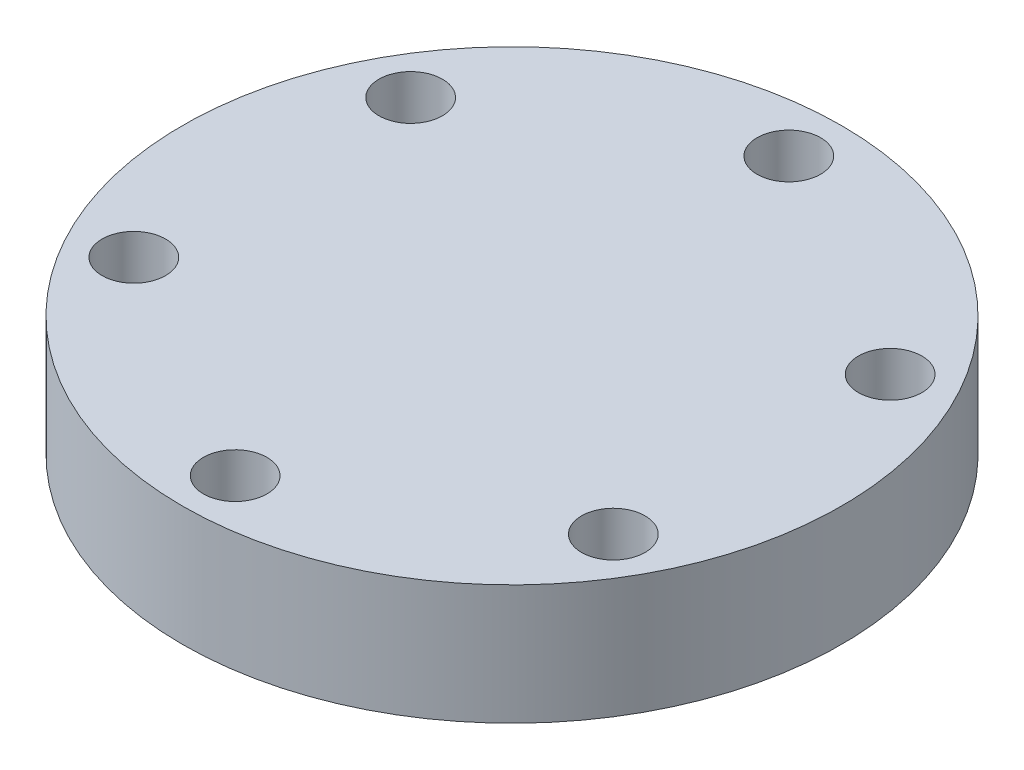
ISO-10303-21;
HEADER;
FILE_DESCRIPTION(('STEP AP214'),'2;1');
FILE_NAME('part.step','',(''),(''),'','','');
FILE_SCHEMA(('AUTOMOTIVE_DESIGN { 1 0 10303 214 1 1 1 1 }'));
ENDSEC;
DATA;
#1=APPLICATION_CONTEXT('core data for automotive mechanical design processes');
#2=APPLICATION_PROTOCOL_DEFINITION('international standard','automotive_design',2000,#1);
#3=PRODUCT_CONTEXT('',#1,'mechanical');
#4=PRODUCT('Part','Part','',(#3));
#5=PRODUCT_RELATED_PRODUCT_CATEGORY('part','',(#4));
#6=PRODUCT_DEFINITION_FORMATION('','',#4);
#7=PRODUCT_DEFINITION_CONTEXT('part definition',#1,'design');
#8=PRODUCT_DEFINITION('design','',#6,#7);
#9=PRODUCT_DEFINITION_SHAPE('','',#8);
#10=(LENGTH_UNIT() NAMED_UNIT(*) SI_UNIT(.MILLI.,.METRE.));
#11=(NAMED_UNIT(*) PLANE_ANGLE_UNIT() SI_UNIT($,.RADIAN.));
#12=(NAMED_UNIT(*) SI_UNIT($,.STERADIAN.) SOLID_ANGLE_UNIT());
#13=UNCERTAINTY_MEASURE_WITH_UNIT(LENGTH_MEASURE(1.E-05),#10,'distance_accuracy_value','');
#14=(GEOMETRIC_REPRESENTATION_CONTEXT(3) GLOBAL_UNCERTAINTY_ASSIGNED_CONTEXT((#13)) GLOBAL_UNIT_ASSIGNED_CONTEXT((#10,
#11,#12)) REPRESENTATION_CONTEXT('',''));
#15=CARTESIAN_POINT('',(0.,0.,0.));
#16=DIRECTION('',(0.,0.,1.));
#17=DIRECTION('',(1.,0.,0.));
#18=AXIS2_PLACEMENT_3D('',#15,#16,#17);
#19=CARTESIAN_POINT('',(0.,12.7,0.));
#20=DIRECTION('',(0.,1.,0.));
#21=DIRECTION('',(0.,0.,1.));
#22=AXIS2_PLACEMENT_3D('',#19,#20,#21);
#23=PLANE('',#22);
#24=CARTESIAN_POINT('',(25.4065872708242,12.7,14.6684999999998));
#25=DIRECTION('',(0.,1.,0.));
#26=DIRECTION('',(-0.866025403784443,0.,-0.499999999999992));
#27=AXIS2_PLACEMENT_3D('',#24,#25,#26);
#28=CIRCLE('',#27,3.3655);
#29=CARTESIAN_POINT('',(22.4919787743877,12.7,12.9857499999998));
#30=VERTEX_POINT('',#29);
#31=EDGE_CURVE('E62',#30,#30,#28,.T.);
#32=ORIENTED_EDGE('',*,*,#31,.F.);
#33=EDGE_LOOP('',(#32));
#34=FACE_BOUND('',#33,.T.);
#35=CARTESIAN_POINT('',(-25.406587270824,12.7,14.6685000000001));
#36=DIRECTION('',(0.,1.,0.));
#37=DIRECTION('',(0.866025403784436,0.,-0.500000000000004));
#38=AXIS2_PLACEMENT_3D('',#35,#36,#37);
#39=CIRCLE('',#38,3.3655);
#40=CARTESIAN_POINT('',(-22.4919787743875,12.7,12.9857500000001));
#41=VERTEX_POINT('',#40);
#42=EDGE_CURVE('E50',#41,#41,#39,.T.);
#43=ORIENTED_EDGE('',*,*,#42,.F.);
#44=EDGE_LOOP('',(#43));
#45=FACE_BOUND('',#44,.T.);
#46=CARTESIAN_POINT('',(0.,12.7,-29.337));
#47=DIRECTION('',(0.,1.,0.));
#48=DIRECTION('',(0.,0.,1.));
#49=AXIS2_PLACEMENT_3D('',#46,#47,#48);
#50=CIRCLE('',#49,3.3655);
#51=CARTESIAN_POINT('',(0.,12.7,-25.9715));
#52=VERTEX_POINT('',#51);
#53=EDGE_CURVE('E39',#52,#52,#50,.T.);
#54=ORIENTED_EDGE('',*,*,#53,.F.);
#55=EDGE_LOOP('',(#54));
#56=FACE_BOUND('',#55,.T.);
#57=CARTESIAN_POINT('',(0.,12.7,0.));
#58=DIRECTION('',(0.,1.,0.));
#59=DIRECTION('',(0.,0.,1.));
#60=AXIS2_PLACEMENT_3D('',#57,#58,#59);
#61=CIRCLE('',#60,34.925);
#62=CARTESIAN_POINT('',(0.,12.7,34.925));
#63=VERTEX_POINT('',#62);
#64=EDGE_CURVE('E10',#63,#63,#61,.T.);
#65=ORIENTED_EDGE('',*,*,#64,.T.);
#66=EDGE_LOOP('',(#65));
#67=FACE_BOUND('',#66,.T.);
#68=CARTESIAN_POINT('',(-25.4065872708241,12.7,-14.6684999999999));
#69=DIRECTION('',(0.,1.,0.));
#70=DIRECTION('',(0.86602540378444,0.,0.499999999999998));
#71=AXIS2_PLACEMENT_3D('',#68,#69,#70);
#72=CIRCLE('',#71,3.3655);
#73=CARTESIAN_POINT('',(-22.4919787743876,12.7,-12.9857499999999));
#74=VERTEX_POINT('',#73);
#75=EDGE_CURVE('E44',#74,#74,#72,.T.);
#76=ORIENTED_EDGE('',*,*,#75,.F.);
#77=EDGE_LOOP('',(#76));
#78=FACE_BOUND('',#77,.T.);
#79=CARTESIAN_POINT('',(2.04859176075282E-13,12.7,29.337));
#80=DIRECTION('',(0.,1.,0.));
#81=DIRECTION('',(0.,0.,-1.));
#82=AXIS2_PLACEMENT_3D('',#79,#80,#81);
#83=CIRCLE('',#82,3.3655);
#84=CARTESIAN_POINT('',(1.81358015183529E-13,12.7,25.9715));
#85=VERTEX_POINT('',#84);
#86=EDGE_CURVE('E56',#85,#85,#83,.T.);
#87=ORIENTED_EDGE('',*,*,#86,.F.);
#88=EDGE_LOOP('',(#87));
#89=FACE_BOUND('',#88,.T.);
#90=CARTESIAN_POINT('',(25.4065872708239,12.7,-14.6685000000003));
#91=DIRECTION('',(0.,1.,0.));
#92=DIRECTION('',(-0.866025403784433,0.,0.50000000000001));
#93=AXIS2_PLACEMENT_3D('',#90,#91,#92);
#94=CIRCLE('',#93,3.3655);
#95=CARTESIAN_POINT('',(22.4919787743874,12.7,-12.9857500000003));
#96=VERTEX_POINT('',#95);
#97=EDGE_CURVE('E68',#96,#96,#94,.T.);
#98=ORIENTED_EDGE('',*,*,#97,.F.);
#99=EDGE_LOOP('',(#98));
#100=FACE_BOUND('',#99,.T.);
#101=ADVANCED_FACE('F28',(#34,#45,#56,#67,#78,#89,#100),#23,.T.);
#102=CARTESIAN_POINT('',(0.,0.,0.));
#103=DIRECTION('',(0.,1.,0.));
#104=DIRECTION('',(0.,0.,1.));
#105=AXIS2_PLACEMENT_3D('',#102,#103,#104);
#106=PLANE('',#105);
#107=CARTESIAN_POINT('',(25.4065872708242,0.,14.6684999999998));
#108=DIRECTION('',(0.,1.,0.));
#109=DIRECTION('',(-0.866025403784443,0.,-0.499999999999992));
#110=AXIS2_PLACEMENT_3D('',#107,#108,#109);
#111=CIRCLE('',#110,3.3655);
#112=CARTESIAN_POINT('',(22.4919787743877,0.,12.9857499999998));
#113=VERTEX_POINT('',#112);
#114=EDGE_CURVE('E65',#113,#113,#111,.T.);
#115=ORIENTED_EDGE('',*,*,#114,.T.);
#116=EDGE_LOOP('',(#115));
#117=FACE_BOUND('',#116,.T.);
#118=CARTESIAN_POINT('',(-25.406587270824,0.,14.6685000000001));
#119=DIRECTION('',(0.,1.,0.));
#120=DIRECTION('',(0.866025403784436,0.,-0.500000000000004));
#121=AXIS2_PLACEMENT_3D('',#118,#119,#120);
#122=CIRCLE('',#121,3.3655);
#123=CARTESIAN_POINT('',(-22.4919787743875,0.,12.9857500000001));
#124=VERTEX_POINT('',#123);
#125=EDGE_CURVE('E53',#124,#124,#122,.T.);
#126=ORIENTED_EDGE('',*,*,#125,.T.);
#127=EDGE_LOOP('',(#126));
#128=FACE_BOUND('',#127,.T.);
#129=CARTESIAN_POINT('',(0.,0.,-29.337));
#130=DIRECTION('',(0.,1.,0.));
#131=DIRECTION('',(0.,0.,1.));
#132=AXIS2_PLACEMENT_3D('',#129,#130,#131);
#133=CIRCLE('',#132,3.3655);
#134=CARTESIAN_POINT('',(0.,0.,-25.9715));
#135=VERTEX_POINT('',#134);
#136=EDGE_CURVE('E41',#135,#135,#133,.T.);
#137=ORIENTED_EDGE('',*,*,#136,.T.);
#138=EDGE_LOOP('',(#137));
#139=FACE_BOUND('',#138,.T.);
#140=CARTESIAN_POINT('',(0.,0.,0.));
#141=DIRECTION('',(0.,1.,0.));
#142=DIRECTION('',(0.,0.,1.));
#143=AXIS2_PLACEMENT_3D('',#140,#141,#142);
#144=CIRCLE('',#143,34.925);
#145=CARTESIAN_POINT('',(0.,0.,34.925));
#146=VERTEX_POINT('',#145);
#147=EDGE_CURVE('E32',#146,#146,#144,.T.);
#148=ORIENTED_EDGE('',*,*,#147,.F.);
#149=EDGE_LOOP('',(#148));
#150=FACE_BOUND('',#149,.T.);
#151=CARTESIAN_POINT('',(-25.4065872708241,0.,-14.6684999999999));
#152=DIRECTION('',(0.,1.,0.));
#153=DIRECTION('',(0.86602540378444,0.,0.499999999999998));
#154=AXIS2_PLACEMENT_3D('',#151,#152,#153);
#155=CIRCLE('',#154,3.3655);
#156=CARTESIAN_POINT('',(-22.4919787743876,0.,-12.9857499999999));
#157=VERTEX_POINT('',#156);
#158=EDGE_CURVE('E47',#157,#157,#155,.T.);
#159=ORIENTED_EDGE('',*,*,#158,.T.);
#160=EDGE_LOOP('',(#159));
#161=FACE_BOUND('',#160,.T.);
#162=CARTESIAN_POINT('',(2.04859176075282E-13,0.,29.337));
#163=DIRECTION('',(0.,1.,0.));
#164=DIRECTION('',(0.,0.,-1.));
#165=AXIS2_PLACEMENT_3D('',#162,#163,#164);
#166=CIRCLE('',#165,3.3655);
#167=CARTESIAN_POINT('',(1.81358015183529E-13,0.,25.9715));
#168=VERTEX_POINT('',#167);
#169=EDGE_CURVE('E59',#168,#168,#166,.T.);
#170=ORIENTED_EDGE('',*,*,#169,.T.);
#171=EDGE_LOOP('',(#170));
#172=FACE_BOUND('',#171,.T.);
#173=CARTESIAN_POINT('',(25.4065872708239,0.,-14.6685000000003));
#174=DIRECTION('',(0.,1.,0.));
#175=DIRECTION('',(-0.866025403784433,0.,0.50000000000001));
#176=AXIS2_PLACEMENT_3D('',#173,#174,#175);
#177=CIRCLE('',#176,3.3655);
#178=CARTESIAN_POINT('',(22.4919787743874,0.,-12.9857500000003));
#179=VERTEX_POINT('',#178);
#180=EDGE_CURVE('E71',#179,#179,#177,.T.);
#181=ORIENTED_EDGE('',*,*,#180,.T.);
#182=EDGE_LOOP('',(#181));
#183=FACE_BOUND('',#182,.T.);
#184=ADVANCED_FACE('F81',(#117,#128,#139,#150,#161,#172,#183),#106,.F.);
#185=CARTESIAN_POINT('',(0.,12.7,0.));
#186=DIRECTION('',(0.,-1.,0.));
#187=DIRECTION('',(0.,0.,-1.));
#188=AXIS2_PLACEMENT_3D('',#185,#186,#187);
#189=CYLINDRICAL_SURFACE('',#188,34.925);
#190=ORIENTED_EDGE('',*,*,#64,.F.);
#191=EDGE_LOOP('',(#190));
#192=FACE_BOUND('',#191,.T.);
#193=ORIENTED_EDGE('',*,*,#147,.T.);
#194=EDGE_LOOP('',(#193));
#195=FACE_BOUND('',#194,.T.);
#196=ADVANCED_FACE('F30',(#192,#195),#189,.T.);
#197=CARTESIAN_POINT('',(0.,12.7,-29.337));
#198=DIRECTION('',(0.,-1.,0.));
#199=DIRECTION('',(0.,0.,-1.));
#200=AXIS2_PLACEMENT_3D('',#197,#198,#199);
#201=CYLINDRICAL_SURFACE('',#200,3.3655);
#202=ORIENTED_EDGE('',*,*,#53,.T.);
#203=EDGE_LOOP('',(#202));
#204=FACE_BOUND('',#203,.T.);
#205=ORIENTED_EDGE('',*,*,#136,.F.);
#206=EDGE_LOOP('',(#205));
#207=FACE_BOUND('',#206,.T.);
#208=ADVANCED_FACE('F91',(#204,#207),#201,.F.);
#209=CARTESIAN_POINT('',(-25.4065872708241,12.7,-14.6684999999999));
#210=DIRECTION('',(0.,-1.,0.));
#211=DIRECTION('',(0.,0.,-1.));
#212=AXIS2_PLACEMENT_3D('',#209,#210,#211);
#213=CYLINDRICAL_SURFACE('',#212,3.3655);
#214=ORIENTED_EDGE('',*,*,#75,.T.);
#215=EDGE_LOOP('',(#214));
#216=FACE_BOUND('',#215,.T.);
#217=ORIENTED_EDGE('',*,*,#158,.F.);
#218=EDGE_LOOP('',(#217));
#219=FACE_BOUND('',#218,.T.);
#220=ADVANCED_FACE('F94',(#216,#219),#213,.F.);
#221=CARTESIAN_POINT('',(-25.406587270824,12.7,14.6685000000001));
#222=DIRECTION('',(0.,-1.,0.));
#223=DIRECTION('',(0.,0.,-1.));
#224=AXIS2_PLACEMENT_3D('',#221,#222,#223);
#225=CYLINDRICAL_SURFACE('',#224,3.3655);
#226=ORIENTED_EDGE('',*,*,#42,.T.);
#227=EDGE_LOOP('',(#226));
#228=FACE_BOUND('',#227,.T.);
#229=ORIENTED_EDGE('',*,*,#125,.F.);
#230=EDGE_LOOP('',(#229));
#231=FACE_BOUND('',#230,.T.);
#232=ADVANCED_FACE('F98',(#228,#231),#225,.F.);
#233=CARTESIAN_POINT('',(2.04859176075282E-13,12.7,29.337));
#234=DIRECTION('',(0.,-1.,0.));
#235=DIRECTION('',(0.,0.,-1.));
#236=AXIS2_PLACEMENT_3D('',#233,#234,#235);
#237=CYLINDRICAL_SURFACE('',#236,3.3655);
#238=ORIENTED_EDGE('',*,*,#86,.T.);
#239=EDGE_LOOP('',(#238));
#240=FACE_BOUND('',#239,.T.);
#241=ORIENTED_EDGE('',*,*,#169,.F.);
#242=EDGE_LOOP('',(#241));
#243=FACE_BOUND('',#242,.T.);
#244=ADVANCED_FACE('F102',(#240,#243),#237,.F.);
#245=CARTESIAN_POINT('',(25.4065872708242,12.7,14.6684999999998));
#246=DIRECTION('',(0.,-1.,0.));
#247=DIRECTION('',(0.,0.,-1.));
#248=AXIS2_PLACEMENT_3D('',#245,#246,#247);
#249=CYLINDRICAL_SURFACE('',#248,3.3655);
#250=ORIENTED_EDGE('',*,*,#31,.T.);
#251=EDGE_LOOP('',(#250));
#252=FACE_BOUND('',#251,.T.);
#253=ORIENTED_EDGE('',*,*,#114,.F.);
#254=EDGE_LOOP('',(#253));
#255=FACE_BOUND('',#254,.T.);
#256=ADVANCED_FACE('F106',(#252,#255),#249,.F.);
#257=CARTESIAN_POINT('',(25.4065872708239,12.7,-14.6685000000003));
#258=DIRECTION('',(0.,-1.,0.));
#259=DIRECTION('',(0.,0.,-1.));
#260=AXIS2_PLACEMENT_3D('',#257,#258,#259);
#261=CYLINDRICAL_SURFACE('',#260,3.3655);
#262=ORIENTED_EDGE('',*,*,#97,.T.);
#263=EDGE_LOOP('',(#262));
#264=FACE_BOUND('',#263,.T.);
#265=ORIENTED_EDGE('',*,*,#180,.F.);
#266=EDGE_LOOP('',(#265));
#267=FACE_BOUND('',#266,.T.);
#268=ADVANCED_FACE('F77',(#264,#267),#261,.F.);
#269=CLOSED_SHELL('',(#101,#184,#196,#208,#220,#232,#244,#256,#268));
#270=MANIFOLD_SOLID_BREP('B2',#269);
#271=ADVANCED_BREP_SHAPE_REPRESENTATION('',(#18,#270),#14);
#272=SHAPE_DEFINITION_REPRESENTATION(#9,#271);
ENDSEC;
END-ISO-10303-21;
